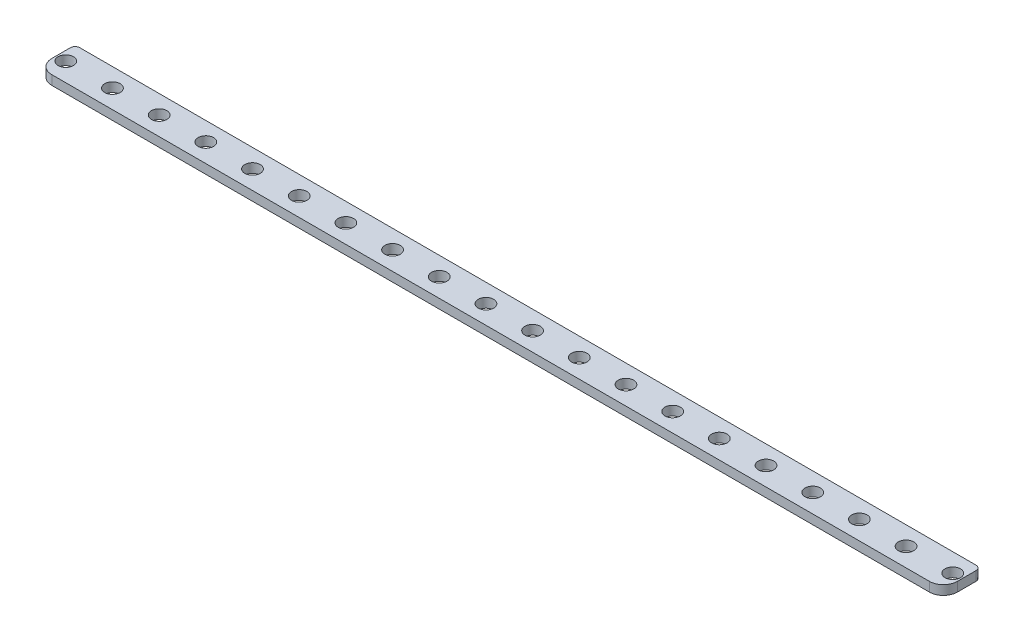
ISO-10303-21;
HEADER;
FILE_DESCRIPTION(('STEP AP214'),'2;1');
FILE_NAME('part.step','',(''),(''),'','','');
FILE_SCHEMA(('AUTOMOTIVE_DESIGN { 1 0 10303 214 1 1 1 1 }'));
ENDSEC;
DATA;
#1=APPLICATION_CONTEXT('core data for automotive mechanical design processes');
#2=APPLICATION_PROTOCOL_DEFINITION('international standard','automotive_design',2000,#1);
#3=PRODUCT_CONTEXT('',#1,'mechanical');
#4=PRODUCT('Part','Part','',(#3));
#5=PRODUCT_RELATED_PRODUCT_CATEGORY('part','',(#4));
#6=PRODUCT_DEFINITION_FORMATION('','',#4);
#7=PRODUCT_DEFINITION_CONTEXT('part definition',#1,'design');
#8=PRODUCT_DEFINITION('design','',#6,#7);
#9=PRODUCT_DEFINITION_SHAPE('','',#8);
#10=(LENGTH_UNIT() NAMED_UNIT(*) SI_UNIT(.MILLI.,.METRE.));
#11=(NAMED_UNIT(*) PLANE_ANGLE_UNIT() SI_UNIT($,.RADIAN.));
#12=(NAMED_UNIT(*) SI_UNIT($,.STERADIAN.) SOLID_ANGLE_UNIT());
#13=UNCERTAINTY_MEASURE_WITH_UNIT(LENGTH_MEASURE(1.E-05),#10,'distance_accuracy_value','');
#14=(GEOMETRIC_REPRESENTATION_CONTEXT(3) GLOBAL_UNCERTAINTY_ASSIGNED_CONTEXT((#13)) GLOBAL_UNIT_ASSIGNED_CONTEXT((#10,
#11,#12)) REPRESENTATION_CONTEXT('',''));
#15=CARTESIAN_POINT('',(0.,0.,0.));
#16=DIRECTION('',(0.,0.,1.));
#17=DIRECTION('',(1.,0.,0.));
#18=AXIS2_PLACEMENT_3D('',#15,#16,#17);
#19=CARTESIAN_POINT('',(-485.,-71.,-40.));
#20=DIRECTION('',(1.,0.,0.));
#21=DIRECTION('',(0.,0.,-1.));
#22=AXIS2_PLACEMENT_3D('',#19,#20,#21);
#23=PLANE('',#22);
#24=DIRECTION('',(0.,0.,1.));
#25=VECTOR('',#24,1.);
#26=CARTESIAN_POINT('',(-485.,-71.,-40.));
#27=LINE('',#26,#25);
#28=CARTESIAN_POINT('',(-485.,-71.,-35.));
#29=VERTEX_POINT('',#28);
#30=CARTESIAN_POINT('',(-485.,-71.,-15.));
#31=VERTEX_POINT('',#30);
#32=EDGE_CURVE('E129',#29,#31,#27,.T.);
#33=ORIENTED_EDGE('',*,*,#32,.T.);
#34=DIRECTION('',(0.,1.,0.));
#35=VECTOR('',#34,1.);
#36=CARTESIAN_POINT('',(-485.,-71.,-15.));
#37=LINE('',#36,#35);
#38=CARTESIAN_POINT('',(-485.,-61.,-15.));
#39=VERTEX_POINT('',#38);
#40=EDGE_CURVE('E143',#39,#31,#37,.F.);
#41=ORIENTED_EDGE('',*,*,#40,.F.);
#42=DIRECTION('',(0.,0.,1.));
#43=VECTOR('',#42,1.);
#44=CARTESIAN_POINT('',(-485.,-61.,-40.));
#45=LINE('',#44,#43);
#46=CARTESIAN_POINT('',(-485.,-61.,-35.));
#47=VERTEX_POINT('',#46);
#48=EDGE_CURVE('E131',#47,#39,#45,.T.);
#49=ORIENTED_EDGE('',*,*,#48,.F.);
#50=DIRECTION('',(0.,1.,0.));
#51=VECTOR('',#50,1.);
#52=CARTESIAN_POINT('',(-485.,-71.,-35.));
#53=LINE('',#52,#51);
#54=EDGE_CURVE('E11',#29,#47,#53,.T.);
#55=ORIENTED_EDGE('',*,*,#54,.F.);
#56=EDGE_LOOP('',(#33,#41,#49,#55));
#57=FACE_BOUND('',#56,.T.);
#58=ADVANCED_FACE('F35',(#57),#23,.F.);
#59=CARTESIAN_POINT('',(-485.,-71.,0.));
#60=DIRECTION('',(0.,0.,-1.));
#61=DIRECTION('',(0.,-1.,0.));
#62=AXIS2_PLACEMENT_3D('',#59,#60,#61);
#63=PLANE('',#62);
#64=DIRECTION('',(1.,0.,0.));
#65=VECTOR('',#64,1.);
#66=CARTESIAN_POINT('',(-485.,-61.,0.));
#67=LINE('',#66,#65);
#68=CARTESIAN_POINT('',(-470.,-61.,0.));
#69=VERTEX_POINT('',#68);
#70=CARTESIAN_POINT('',(470.,-61.,0.));
#71=VERTEX_POINT('',#70);
#72=EDGE_CURVE('E109',#69,#71,#67,.T.);
#73=ORIENTED_EDGE('',*,*,#72,.F.);
#74=DIRECTION('',(0.,1.,0.));
#75=VECTOR('',#74,1.);
#76=CARTESIAN_POINT('',(-470.,-71.,0.));
#77=LINE('',#76,#75);
#78=CARTESIAN_POINT('',(-470.,-71.,0.));
#79=VERTEX_POINT('',#78);
#80=EDGE_CURVE('E113',#79,#69,#77,.T.);
#81=ORIENTED_EDGE('',*,*,#80,.F.);
#82=DIRECTION('',(1.,0.,0.));
#83=VECTOR('',#82,1.);
#84=CARTESIAN_POINT('',(-485.,-71.,0.));
#85=LINE('',#84,#83);
#86=CARTESIAN_POINT('',(470.,-71.,0.));
#87=VERTEX_POINT('',#86);
#88=EDGE_CURVE('E280',#79,#87,#85,.T.);
#89=ORIENTED_EDGE('',*,*,#88,.T.);
#90=DIRECTION('',(0.,1.,0.));
#91=VECTOR('',#90,1.);
#92=CARTESIAN_POINT('',(470.,-71.,0.));
#93=LINE('',#92,#91);
#94=EDGE_CURVE('E138',#71,#87,#93,.F.);
#95=ORIENTED_EDGE('',*,*,#94,.F.);
#96=EDGE_LOOP('',(#73,#81,#89,#95));
#97=FACE_BOUND('',#96,.T.);
#98=ADVANCED_FACE('F296',(#97),#63,.F.);
#99=CARTESIAN_POINT('',(485.,-71.,-40.));
#100=DIRECTION('',(-1.,0.,0.));
#101=DIRECTION('',(0.,0.,1.));
#102=AXIS2_PLACEMENT_3D('',#99,#100,#101);
#103=PLANE('',#102);
#104=DIRECTION('',(0.,0.,-1.));
#105=VECTOR('',#104,1.);
#106=CARTESIAN_POINT('',(485.,-61.,-40.));
#107=LINE('',#106,#105);
#108=CARTESIAN_POINT('',(485.,-61.,-15.));
#109=VERTEX_POINT('',#108);
#110=CARTESIAN_POINT('',(485.,-61.,-35.));
#111=VERTEX_POINT('',#110);
#112=EDGE_CURVE('E107',#109,#111,#107,.T.);
#113=ORIENTED_EDGE('',*,*,#112,.F.);
#114=DIRECTION('',(0.,1.,0.));
#115=VECTOR('',#114,1.);
#116=CARTESIAN_POINT('',(485.,-71.,-15.));
#117=LINE('',#116,#115);
#118=CARTESIAN_POINT('',(485.,-71.,-15.));
#119=VERTEX_POINT('',#118);
#120=EDGE_CURVE('E117',#119,#109,#117,.T.);
#121=ORIENTED_EDGE('',*,*,#120,.F.);
#122=DIRECTION('',(0.,0.,-1.));
#123=VECTOR('',#122,1.);
#124=CARTESIAN_POINT('',(485.,-71.,-40.));
#125=LINE('',#124,#123);
#126=CARTESIAN_POINT('',(485.,-71.,-35.));
#127=VERTEX_POINT('',#126);
#128=EDGE_CURVE('E283',#119,#127,#125,.T.);
#129=ORIENTED_EDGE('',*,*,#128,.T.);
#130=DIRECTION('',(0.,1.,0.));
#131=VECTOR('',#130,1.);
#132=CARTESIAN_POINT('',(485.,-71.,-35.));
#133=LINE('',#132,#131);
#134=EDGE_CURVE('E126',#111,#127,#133,.F.);
#135=ORIENTED_EDGE('',*,*,#134,.F.);
#136=EDGE_LOOP('',(#113,#121,#129,#135));
#137=FACE_BOUND('',#136,.T.);
#138=ADVANCED_FACE('F125',(#137),#103,.F.);
#139=CARTESIAN_POINT('',(-485.,-71.,-40.));
#140=DIRECTION('',(0.,0.,1.));
#141=DIRECTION('',(0.,1.,0.));
#142=AXIS2_PLACEMENT_3D('',#139,#140,#141);
#143=PLANE('',#142);
#144=DIRECTION('',(-1.,0.,0.));
#145=VECTOR('',#144,1.);
#146=CARTESIAN_POINT('',(-485.,-71.,-40.));
#147=LINE('',#146,#145);
#148=CARTESIAN_POINT('',(480.,-71.,-40.));
#149=VERTEX_POINT('',#148);
#150=CARTESIAN_POINT('',(-480.,-71.,-40.));
#151=VERTEX_POINT('',#150);
#152=EDGE_CURVE('E122',#149,#151,#147,.T.);
#153=ORIENTED_EDGE('',*,*,#152,.T.);
#154=DIRECTION('',(0.,1.,0.));
#155=VECTOR('',#154,1.);
#156=CARTESIAN_POINT('',(-480.,-71.,-40.));
#157=LINE('',#156,#155);
#158=CARTESIAN_POINT('',(-480.,-61.,-40.));
#159=VERTEX_POINT('',#158);
#160=EDGE_CURVE('E146',#159,#151,#157,.F.);
#161=ORIENTED_EDGE('',*,*,#160,.F.);
#162=DIRECTION('',(-1.,0.,0.));
#163=VECTOR('',#162,1.);
#164=CARTESIAN_POINT('',(-485.,-61.,-40.));
#165=LINE('',#164,#163);
#166=CARTESIAN_POINT('',(480.,-61.,-40.));
#167=VERTEX_POINT('',#166);
#168=EDGE_CURVE('E127',#167,#159,#165,.T.);
#169=ORIENTED_EDGE('',*,*,#168,.F.);
#170=DIRECTION('',(0.,1.,0.));
#171=VECTOR('',#170,1.);
#172=CARTESIAN_POINT('',(480.,-71.,-40.));
#173=LINE('',#172,#171);
#174=EDGE_CURVE('E148',#149,#167,#173,.T.);
#175=ORIENTED_EDGE('',*,*,#174,.F.);
#176=EDGE_LOOP('',(#153,#161,#169,#175));
#177=FACE_BOUND('',#176,.T.);
#178=ADVANCED_FACE('F302',(#177),#143,.F.);
#179=CARTESIAN_POINT('',(0.,-71.,0.));
#180=DIRECTION('',(0.,-1.,0.));
#181=DIRECTION('',(0.,0.,1.));
#182=AXIS2_PLACEMENT_3D('',#179,#180,#181);
#183=PLANE('',#182);
#184=CARTESIAN_POINT('',(475.,-71.,-20.));
#185=DIRECTION('',(0.,1.,0.));
#186=DIRECTION('',(0.,0.,1.));
#187=AXIS2_PLACEMENT_3D('',#184,#185,#186);
#188=CIRCLE('',#187,8.24999999999999);
#189=CARTESIAN_POINT('',(475.,-71.,-11.75));
#190=VERTEX_POINT('',#189);
#191=EDGE_CURVE('E241',#190,#190,#188,.T.);
#192=ORIENTED_EDGE('',*,*,#191,.T.);
#193=EDGE_LOOP('',(#192));
#194=FACE_BOUND('',#193,.T.);
#195=CARTESIAN_POINT('',(425.,-71.,-20.));
#196=DIRECTION('',(0.,1.,0.));
#197=DIRECTION('',(0.,0.,1.));
#198=AXIS2_PLACEMENT_3D('',#195,#196,#197);
#199=CIRCLE('',#198,8.24999999999999);
#200=CARTESIAN_POINT('',(425.,-71.,-11.75));
#201=VERTEX_POINT('',#200);
#202=EDGE_CURVE('E231',#201,#201,#199,.T.);
#203=ORIENTED_EDGE('',*,*,#202,.T.);
#204=EDGE_LOOP('',(#203));
#205=FACE_BOUND('',#204,.T.);
#206=CARTESIAN_POINT('',(375.,-71.,-20.));
#207=DIRECTION('',(0.,1.,0.));
#208=DIRECTION('',(0.,0.,1.));
#209=AXIS2_PLACEMENT_3D('',#206,#207,#208);
#210=CIRCLE('',#209,8.24999999999999);
#211=CARTESIAN_POINT('',(375.,-71.,-11.75));
#212=VERTEX_POINT('',#211);
#213=EDGE_CURVE('E228',#212,#212,#210,.T.);
#214=ORIENTED_EDGE('',*,*,#213,.T.);
#215=EDGE_LOOP('',(#214));
#216=FACE_BOUND('',#215,.T.);
#217=CARTESIAN_POINT('',(325.,-71.,-20.));
#218=DIRECTION('',(0.,1.,0.));
#219=DIRECTION('',(0.,0.,1.));
#220=AXIS2_PLACEMENT_3D('',#217,#218,#219);
#221=CIRCLE('',#220,8.24999999999999);
#222=CARTESIAN_POINT('',(325.,-71.,-11.75));
#223=VERTEX_POINT('',#222);
#224=EDGE_CURVE('E225',#223,#223,#221,.T.);
#225=ORIENTED_EDGE('',*,*,#224,.T.);
#226=EDGE_LOOP('',(#225));
#227=FACE_BOUND('',#226,.T.);
#228=CARTESIAN_POINT('',(275.,-71.,-20.));
#229=DIRECTION('',(0.,1.,0.));
#230=DIRECTION('',(0.,0.,1.));
#231=AXIS2_PLACEMENT_3D('',#228,#229,#230);
#232=CIRCLE('',#231,8.24999999999999);
#233=CARTESIAN_POINT('',(275.,-71.,-11.75));
#234=VERTEX_POINT('',#233);
#235=EDGE_CURVE('E221',#234,#234,#232,.T.);
#236=ORIENTED_EDGE('',*,*,#235,.T.);
#237=EDGE_LOOP('',(#236));
#238=FACE_BOUND('',#237,.T.);
#239=CARTESIAN_POINT('',(225.,-71.,-20.));
#240=DIRECTION('',(0.,1.,0.));
#241=DIRECTION('',(0.,0.,1.));
#242=AXIS2_PLACEMENT_3D('',#239,#240,#241);
#243=CIRCLE('',#242,8.24999999999999);
#244=CARTESIAN_POINT('',(225.,-71.,-11.75));
#245=VERTEX_POINT('',#244);
#246=EDGE_CURVE('E217',#245,#245,#243,.T.);
#247=ORIENTED_EDGE('',*,*,#246,.T.);
#248=EDGE_LOOP('',(#247));
#249=FACE_BOUND('',#248,.T.);
#250=CARTESIAN_POINT('',(175.,-71.,-20.));
#251=DIRECTION('',(0.,1.,0.));
#252=DIRECTION('',(0.,0.,1.));
#253=AXIS2_PLACEMENT_3D('',#250,#251,#252);
#254=CIRCLE('',#253,8.24999999999999);
#255=CARTESIAN_POINT('',(175.,-71.,-11.75));
#256=VERTEX_POINT('',#255);
#257=EDGE_CURVE('E213',#256,#256,#254,.T.);
#258=ORIENTED_EDGE('',*,*,#257,.T.);
#259=EDGE_LOOP('',(#258));
#260=FACE_BOUND('',#259,.T.);
#261=CARTESIAN_POINT('',(125.,-71.,-20.));
#262=DIRECTION('',(0.,1.,0.));
#263=DIRECTION('',(0.,0.,1.));
#264=AXIS2_PLACEMENT_3D('',#261,#262,#263);
#265=CIRCLE('',#264,8.24999999999999);
#266=CARTESIAN_POINT('',(125.,-71.,-11.75));
#267=VERTEX_POINT('',#266);
#268=EDGE_CURVE('E209',#267,#267,#265,.T.);
#269=ORIENTED_EDGE('',*,*,#268,.T.);
#270=EDGE_LOOP('',(#269));
#271=FACE_BOUND('',#270,.T.);
#272=CARTESIAN_POINT('',(75.,-71.,-20.));
#273=DIRECTION('',(0.,1.,0.));
#274=DIRECTION('',(0.,0.,1.));
#275=AXIS2_PLACEMENT_3D('',#272,#273,#274);
#276=CIRCLE('',#275,8.24999999999999);
#277=CARTESIAN_POINT('',(75.,-71.,-11.75));
#278=VERTEX_POINT('',#277);
#279=EDGE_CURVE('E205',#278,#278,#276,.T.);
#280=ORIENTED_EDGE('',*,*,#279,.T.);
#281=EDGE_LOOP('',(#280));
#282=FACE_BOUND('',#281,.T.);
#283=CARTESIAN_POINT('',(25.,-71.,-20.));
#284=DIRECTION('',(0.,1.,0.));
#285=DIRECTION('',(0.,0.,1.));
#286=AXIS2_PLACEMENT_3D('',#283,#284,#285);
#287=CIRCLE('',#286,8.24999999999999);
#288=CARTESIAN_POINT('',(25.,-71.,-11.75));
#289=VERTEX_POINT('',#288);
#290=EDGE_CURVE('E201',#289,#289,#287,.T.);
#291=ORIENTED_EDGE('',*,*,#290,.T.);
#292=EDGE_LOOP('',(#291));
#293=FACE_BOUND('',#292,.T.);
#294=CARTESIAN_POINT('',(-25.,-71.,-20.));
#295=DIRECTION('',(0.,1.,0.));
#296=DIRECTION('',(0.,0.,1.));
#297=AXIS2_PLACEMENT_3D('',#294,#295,#296);
#298=CIRCLE('',#297,8.24999999999999);
#299=CARTESIAN_POINT('',(-25.,-71.,-11.75));
#300=VERTEX_POINT('',#299);
#301=EDGE_CURVE('E197',#300,#300,#298,.T.);
#302=ORIENTED_EDGE('',*,*,#301,.T.);
#303=EDGE_LOOP('',(#302));
#304=FACE_BOUND('',#303,.T.);
#305=CARTESIAN_POINT('',(-75.,-71.,-20.));
#306=DIRECTION('',(0.,1.,0.));
#307=DIRECTION('',(0.,0.,1.));
#308=AXIS2_PLACEMENT_3D('',#305,#306,#307);
#309=CIRCLE('',#308,8.24999999999999);
#310=CARTESIAN_POINT('',(-75.,-71.,-11.75));
#311=VERTEX_POINT('',#310);
#312=EDGE_CURVE('E193',#311,#311,#309,.T.);
#313=ORIENTED_EDGE('',*,*,#312,.T.);
#314=EDGE_LOOP('',(#313));
#315=FACE_BOUND('',#314,.T.);
#316=CARTESIAN_POINT('',(-125.,-71.,-20.));
#317=DIRECTION('',(0.,1.,0.));
#318=DIRECTION('',(0.,0.,1.));
#319=AXIS2_PLACEMENT_3D('',#316,#317,#318);
#320=CIRCLE('',#319,8.24999999999999);
#321=CARTESIAN_POINT('',(-125.,-71.,-11.75));
#322=VERTEX_POINT('',#321);
#323=EDGE_CURVE('E189',#322,#322,#320,.T.);
#324=ORIENTED_EDGE('',*,*,#323,.T.);
#325=EDGE_LOOP('',(#324));
#326=FACE_BOUND('',#325,.T.);
#327=CARTESIAN_POINT('',(-175.,-71.,-20.));
#328=DIRECTION('',(0.,1.,0.));
#329=DIRECTION('',(0.,0.,1.));
#330=AXIS2_PLACEMENT_3D('',#327,#328,#329);
#331=CIRCLE('',#330,8.24999999999999);
#332=CARTESIAN_POINT('',(-175.,-71.,-11.75));
#333=VERTEX_POINT('',#332);
#334=EDGE_CURVE('E185',#333,#333,#331,.T.);
#335=ORIENTED_EDGE('',*,*,#334,.T.);
#336=EDGE_LOOP('',(#335));
#337=FACE_BOUND('',#336,.T.);
#338=CARTESIAN_POINT('',(-225.,-71.,-20.));
#339=DIRECTION('',(0.,1.,0.));
#340=DIRECTION('',(0.,0.,1.));
#341=AXIS2_PLACEMENT_3D('',#338,#339,#340);
#342=CIRCLE('',#341,8.24999999999999);
#343=CARTESIAN_POINT('',(-225.,-71.,-11.75));
#344=VERTEX_POINT('',#343);
#345=EDGE_CURVE('E181',#344,#344,#342,.T.);
#346=ORIENTED_EDGE('',*,*,#345,.T.);
#347=EDGE_LOOP('',(#346));
#348=FACE_BOUND('',#347,.T.);
#349=CARTESIAN_POINT('',(-275.,-71.,-20.));
#350=DIRECTION('',(0.,1.,0.));
#351=DIRECTION('',(0.,0.,1.));
#352=AXIS2_PLACEMENT_3D('',#349,#350,#351);
#353=CIRCLE('',#352,8.24999999999999);
#354=CARTESIAN_POINT('',(-275.,-71.,-11.75));
#355=VERTEX_POINT('',#354);
#356=EDGE_CURVE('E177',#355,#355,#353,.T.);
#357=ORIENTED_EDGE('',*,*,#356,.T.);
#358=EDGE_LOOP('',(#357));
#359=FACE_BOUND('',#358,.T.);
#360=CARTESIAN_POINT('',(-325.,-71.,-20.));
#361=DIRECTION('',(0.,1.,0.));
#362=DIRECTION('',(0.,0.,1.));
#363=AXIS2_PLACEMENT_3D('',#360,#361,#362);
#364=CIRCLE('',#363,8.24999999999999);
#365=CARTESIAN_POINT('',(-325.,-71.,-11.75));
#366=VERTEX_POINT('',#365);
#367=EDGE_CURVE('E173',#366,#366,#364,.T.);
#368=ORIENTED_EDGE('',*,*,#367,.T.);
#369=EDGE_LOOP('',(#368));
#370=FACE_BOUND('',#369,.T.);
#371=CARTESIAN_POINT('',(-375.,-71.,-20.));
#372=DIRECTION('',(0.,1.,0.));
#373=DIRECTION('',(0.,0.,1.));
#374=AXIS2_PLACEMENT_3D('',#371,#372,#373);
#375=CIRCLE('',#374,8.24999999999999);
#376=CARTESIAN_POINT('',(-375.,-71.,-11.75));
#377=VERTEX_POINT('',#376);
#378=EDGE_CURVE('E169',#377,#377,#375,.T.);
#379=ORIENTED_EDGE('',*,*,#378,.T.);
#380=EDGE_LOOP('',(#379));
#381=FACE_BOUND('',#380,.T.);
#382=CARTESIAN_POINT('',(-425.,-71.,-20.));
#383=DIRECTION('',(0.,1.,0.));
#384=DIRECTION('',(0.,0.,1.));
#385=AXIS2_PLACEMENT_3D('',#382,#383,#384);
#386=CIRCLE('',#385,8.24999999999999);
#387=CARTESIAN_POINT('',(-425.,-71.,-11.75));
#388=VERTEX_POINT('',#387);
#389=EDGE_CURVE('E165',#388,#388,#386,.T.);
#390=ORIENTED_EDGE('',*,*,#389,.T.);
#391=EDGE_LOOP('',(#390));
#392=FACE_BOUND('',#391,.T.);
#393=CARTESIAN_POINT('',(-475.,-71.,-20.));
#394=DIRECTION('',(0.,1.,0.));
#395=DIRECTION('',(0.,0.,1.));
#396=AXIS2_PLACEMENT_3D('',#393,#394,#395);
#397=CIRCLE('',#396,8.24999999999999);
#398=CARTESIAN_POINT('',(-475.,-71.,-11.75));
#399=VERTEX_POINT('',#398);
#400=EDGE_CURVE('E161',#399,#399,#397,.T.);
#401=ORIENTED_EDGE('',*,*,#400,.T.);
#402=EDGE_LOOP('',(#401));
#403=FACE_BOUND('',#402,.T.);
#404=ORIENTED_EDGE('',*,*,#128,.F.);
#405=CARTESIAN_POINT('',(470.,-71.,-15.));
#406=DIRECTION('',(0.,1.,0.));
#407=DIRECTION('',(0.,0.,1.));
#408=AXIS2_PLACEMENT_3D('',#405,#406,#407);
#409=CIRCLE('',#408,15.);
#410=EDGE_CURVE('E119',#87,#119,#409,.T.);
#411=ORIENTED_EDGE('',*,*,#410,.F.);
#412=ORIENTED_EDGE('',*,*,#88,.F.);
#413=CARTESIAN_POINT('',(-470.,-71.,-15.));
#414=DIRECTION('',(0.,1.,0.));
#415=DIRECTION('',(0.,0.,1.));
#416=AXIS2_PLACEMENT_3D('',#413,#414,#415);
#417=CIRCLE('',#416,15.);
#418=EDGE_CURVE('E140',#31,#79,#417,.T.);
#419=ORIENTED_EDGE('',*,*,#418,.F.);
#420=ORIENTED_EDGE('',*,*,#32,.F.);
#421=CARTESIAN_POINT('',(-480.,-71.,-35.));
#422=DIRECTION('',(0.,1.,0.));
#423=DIRECTION('',(0.,0.,1.));
#424=AXIS2_PLACEMENT_3D('',#421,#422,#423);
#425=CIRCLE('',#424,5.);
#426=EDGE_CURVE('E51',#151,#29,#425,.T.);
#427=ORIENTED_EDGE('',*,*,#426,.F.);
#428=ORIENTED_EDGE('',*,*,#152,.F.);
#429=CARTESIAN_POINT('',(480.,-71.,-35.));
#430=DIRECTION('',(0.,1.,0.));
#431=DIRECTION('',(0.,0.,1.));
#432=AXIS2_PLACEMENT_3D('',#429,#430,#431);
#433=CIRCLE('',#432,5.);
#434=EDGE_CURVE('E44',#127,#149,#433,.T.);
#435=ORIENTED_EDGE('',*,*,#434,.F.);
#436=EDGE_LOOP('',(#404,#411,#412,#419,#420,#427,#428,#435));
#437=FACE_BOUND('',#436,.T.);
#438=ADVANCED_FACE('F297',(#194,#205,#216,#227,#238,#249,#260,#271,#282,#293,#304,#315,#326,
#337,#348,#359,#370,#381,#392,#403,#437),#183,.T.);
#439=CARTESIAN_POINT('',(0.,-61.,0.));
#440=DIRECTION('',(0.,-1.,0.));
#441=DIRECTION('',(0.,0.,1.));
#442=AXIS2_PLACEMENT_3D('',#439,#440,#441);
#443=PLANE('',#442);
#444=CARTESIAN_POINT('',(475.,-61.,-20.));
#445=DIRECTION('',(0.,-1.,0.));
#446=DIRECTION('',(0.,0.,-1.));
#447=AXIS2_PLACEMENT_3D('',#444,#445,#446);
#448=CIRCLE('',#447,8.24999999999999);
#449=CARTESIAN_POINT('',(475.,-61.,-28.25));
#450=VERTEX_POINT('',#449);
#451=EDGE_CURVE('E39',#450,#450,#448,.T.);
#452=ORIENTED_EDGE('',*,*,#451,.T.);
#453=EDGE_LOOP('',(#452));
#454=FACE_BOUND('',#453,.T.);
#455=CARTESIAN_POINT('',(425.,-61.,-20.));
#456=DIRECTION('',(0.,-1.,0.));
#457=DIRECTION('',(0.,0.,-1.));
#458=AXIS2_PLACEMENT_3D('',#455,#456,#457);
#459=CIRCLE('',#458,8.24999999999999);
#460=CARTESIAN_POINT('',(425.,-61.,-28.25));
#461=VERTEX_POINT('',#460);
#462=EDGE_CURVE('E229',#461,#461,#459,.T.);
#463=ORIENTED_EDGE('',*,*,#462,.T.);
#464=EDGE_LOOP('',(#463));
#465=FACE_BOUND('',#464,.T.);
#466=CARTESIAN_POINT('',(375.,-61.,-20.));
#467=DIRECTION('',(0.,-1.,0.));
#468=DIRECTION('',(0.,0.,-1.));
#469=AXIS2_PLACEMENT_3D('',#466,#467,#468);
#470=CIRCLE('',#469,8.24999999999999);
#471=CARTESIAN_POINT('',(375.,-61.,-28.25));
#472=VERTEX_POINT('',#471);
#473=EDGE_CURVE('E226',#472,#472,#470,.T.);
#474=ORIENTED_EDGE('',*,*,#473,.T.);
#475=EDGE_LOOP('',(#474));
#476=FACE_BOUND('',#475,.T.);
#477=CARTESIAN_POINT('',(325.,-61.,-20.));
#478=DIRECTION('',(0.,-1.,0.));
#479=DIRECTION('',(0.,0.,-1.));
#480=AXIS2_PLACEMENT_3D('',#477,#478,#479);
#481=CIRCLE('',#480,8.24999999999999);
#482=CARTESIAN_POINT('',(325.,-61.,-28.25));
#483=VERTEX_POINT('',#482);
#484=EDGE_CURVE('E222',#483,#483,#481,.T.);
#485=ORIENTED_EDGE('',*,*,#484,.T.);
#486=EDGE_LOOP('',(#485));
#487=FACE_BOUND('',#486,.T.);
#488=CARTESIAN_POINT('',(275.,-61.,-20.));
#489=DIRECTION('',(0.,-1.,0.));
#490=DIRECTION('',(0.,0.,-1.));
#491=AXIS2_PLACEMENT_3D('',#488,#489,#490);
#492=CIRCLE('',#491,8.24999999999999);
#493=CARTESIAN_POINT('',(275.,-61.,-28.25));
#494=VERTEX_POINT('',#493);
#495=EDGE_CURVE('E218',#494,#494,#492,.T.);
#496=ORIENTED_EDGE('',*,*,#495,.T.);
#497=EDGE_LOOP('',(#496));
#498=FACE_BOUND('',#497,.T.);
#499=CARTESIAN_POINT('',(225.,-61.,-20.));
#500=DIRECTION('',(0.,-1.,0.));
#501=DIRECTION('',(0.,0.,-1.));
#502=AXIS2_PLACEMENT_3D('',#499,#500,#501);
#503=CIRCLE('',#502,8.24999999999999);
#504=CARTESIAN_POINT('',(225.,-61.,-28.25));
#505=VERTEX_POINT('',#504);
#506=EDGE_CURVE('E214',#505,#505,#503,.T.);
#507=ORIENTED_EDGE('',*,*,#506,.T.);
#508=EDGE_LOOP('',(#507));
#509=FACE_BOUND('',#508,.T.);
#510=CARTESIAN_POINT('',(175.,-61.,-20.));
#511=DIRECTION('',(0.,-1.,0.));
#512=DIRECTION('',(0.,0.,-1.));
#513=AXIS2_PLACEMENT_3D('',#510,#511,#512);
#514=CIRCLE('',#513,8.24999999999999);
#515=CARTESIAN_POINT('',(175.,-61.,-28.25));
#516=VERTEX_POINT('',#515);
#517=EDGE_CURVE('E210',#516,#516,#514,.T.);
#518=ORIENTED_EDGE('',*,*,#517,.T.);
#519=EDGE_LOOP('',(#518));
#520=FACE_BOUND('',#519,.T.);
#521=CARTESIAN_POINT('',(125.,-61.,-20.));
#522=DIRECTION('',(0.,-1.,0.));
#523=DIRECTION('',(0.,0.,-1.));
#524=AXIS2_PLACEMENT_3D('',#521,#522,#523);
#525=CIRCLE('',#524,8.24999999999999);
#526=CARTESIAN_POINT('',(125.,-61.,-28.25));
#527=VERTEX_POINT('',#526);
#528=EDGE_CURVE('E206',#527,#527,#525,.T.);
#529=ORIENTED_EDGE('',*,*,#528,.T.);
#530=EDGE_LOOP('',(#529));
#531=FACE_BOUND('',#530,.T.);
#532=CARTESIAN_POINT('',(75.,-61.,-20.));
#533=DIRECTION('',(0.,-1.,0.));
#534=DIRECTION('',(0.,0.,-1.));
#535=AXIS2_PLACEMENT_3D('',#532,#533,#534);
#536=CIRCLE('',#535,8.24999999999999);
#537=CARTESIAN_POINT('',(75.,-61.,-28.25));
#538=VERTEX_POINT('',#537);
#539=EDGE_CURVE('E202',#538,#538,#536,.T.);
#540=ORIENTED_EDGE('',*,*,#539,.T.);
#541=EDGE_LOOP('',(#540));
#542=FACE_BOUND('',#541,.T.);
#543=CARTESIAN_POINT('',(25.,-61.,-20.));
#544=DIRECTION('',(0.,-1.,0.));
#545=DIRECTION('',(0.,0.,-1.));
#546=AXIS2_PLACEMENT_3D('',#543,#544,#545);
#547=CIRCLE('',#546,8.24999999999999);
#548=CARTESIAN_POINT('',(25.,-61.,-28.25));
#549=VERTEX_POINT('',#548);
#550=EDGE_CURVE('E198',#549,#549,#547,.T.);
#551=ORIENTED_EDGE('',*,*,#550,.T.);
#552=EDGE_LOOP('',(#551));
#553=FACE_BOUND('',#552,.T.);
#554=CARTESIAN_POINT('',(-25.,-61.,-20.));
#555=DIRECTION('',(0.,-1.,0.));
#556=DIRECTION('',(0.,0.,-1.));
#557=AXIS2_PLACEMENT_3D('',#554,#555,#556);
#558=CIRCLE('',#557,8.24999999999999);
#559=CARTESIAN_POINT('',(-25.,-61.,-28.25));
#560=VERTEX_POINT('',#559);
#561=EDGE_CURVE('E194',#560,#560,#558,.T.);
#562=ORIENTED_EDGE('',*,*,#561,.T.);
#563=EDGE_LOOP('',(#562));
#564=FACE_BOUND('',#563,.T.);
#565=CARTESIAN_POINT('',(-75.,-61.,-20.));
#566=DIRECTION('',(0.,-1.,0.));
#567=DIRECTION('',(0.,0.,-1.));
#568=AXIS2_PLACEMENT_3D('',#565,#566,#567);
#569=CIRCLE('',#568,8.24999999999999);
#570=CARTESIAN_POINT('',(-75.,-61.,-28.25));
#571=VERTEX_POINT('',#570);
#572=EDGE_CURVE('E190',#571,#571,#569,.T.);
#573=ORIENTED_EDGE('',*,*,#572,.T.);
#574=EDGE_LOOP('',(#573));
#575=FACE_BOUND('',#574,.T.);
#576=CARTESIAN_POINT('',(-125.,-61.,-20.));
#577=DIRECTION('',(0.,-1.,0.));
#578=DIRECTION('',(0.,0.,-1.));
#579=AXIS2_PLACEMENT_3D('',#576,#577,#578);
#580=CIRCLE('',#579,8.24999999999999);
#581=CARTESIAN_POINT('',(-125.,-61.,-28.25));
#582=VERTEX_POINT('',#581);
#583=EDGE_CURVE('E186',#582,#582,#580,.T.);
#584=ORIENTED_EDGE('',*,*,#583,.T.);
#585=EDGE_LOOP('',(#584));
#586=FACE_BOUND('',#585,.T.);
#587=CARTESIAN_POINT('',(-175.,-61.,-20.));
#588=DIRECTION('',(0.,-1.,0.));
#589=DIRECTION('',(0.,0.,-1.));
#590=AXIS2_PLACEMENT_3D('',#587,#588,#589);
#591=CIRCLE('',#590,8.24999999999999);
#592=CARTESIAN_POINT('',(-175.,-61.,-28.25));
#593=VERTEX_POINT('',#592);
#594=EDGE_CURVE('E182',#593,#593,#591,.T.);
#595=ORIENTED_EDGE('',*,*,#594,.T.);
#596=EDGE_LOOP('',(#595));
#597=FACE_BOUND('',#596,.T.);
#598=CARTESIAN_POINT('',(-225.,-61.,-20.));
#599=DIRECTION('',(0.,-1.,0.));
#600=DIRECTION('',(0.,0.,-1.));
#601=AXIS2_PLACEMENT_3D('',#598,#599,#600);
#602=CIRCLE('',#601,8.24999999999999);
#603=CARTESIAN_POINT('',(-225.,-61.,-28.25));
#604=VERTEX_POINT('',#603);
#605=EDGE_CURVE('E178',#604,#604,#602,.T.);
#606=ORIENTED_EDGE('',*,*,#605,.T.);
#607=EDGE_LOOP('',(#606));
#608=FACE_BOUND('',#607,.T.);
#609=CARTESIAN_POINT('',(-275.,-61.,-20.));
#610=DIRECTION('',(0.,-1.,0.));
#611=DIRECTION('',(0.,0.,-1.));
#612=AXIS2_PLACEMENT_3D('',#609,#610,#611);
#613=CIRCLE('',#612,8.24999999999999);
#614=CARTESIAN_POINT('',(-275.,-61.,-28.25));
#615=VERTEX_POINT('',#614);
#616=EDGE_CURVE('E174',#615,#615,#613,.T.);
#617=ORIENTED_EDGE('',*,*,#616,.T.);
#618=EDGE_LOOP('',(#617));
#619=FACE_BOUND('',#618,.T.);
#620=CARTESIAN_POINT('',(-325.,-61.,-20.));
#621=DIRECTION('',(0.,-1.,0.));
#622=DIRECTION('',(0.,0.,-1.));
#623=AXIS2_PLACEMENT_3D('',#620,#621,#622);
#624=CIRCLE('',#623,8.24999999999999);
#625=CARTESIAN_POINT('',(-325.,-61.,-28.25));
#626=VERTEX_POINT('',#625);
#627=EDGE_CURVE('E170',#626,#626,#624,.T.);
#628=ORIENTED_EDGE('',*,*,#627,.T.);
#629=EDGE_LOOP('',(#628));
#630=FACE_BOUND('',#629,.T.);
#631=CARTESIAN_POINT('',(-375.,-61.,-20.));
#632=DIRECTION('',(0.,-1.,0.));
#633=DIRECTION('',(0.,0.,-1.));
#634=AXIS2_PLACEMENT_3D('',#631,#632,#633);
#635=CIRCLE('',#634,8.24999999999999);
#636=CARTESIAN_POINT('',(-375.,-61.,-28.25));
#637=VERTEX_POINT('',#636);
#638=EDGE_CURVE('E166',#637,#637,#635,.T.);
#639=ORIENTED_EDGE('',*,*,#638,.T.);
#640=EDGE_LOOP('',(#639));
#641=FACE_BOUND('',#640,.T.);
#642=CARTESIAN_POINT('',(-425.,-61.,-20.));
#643=DIRECTION('',(0.,-1.,0.));
#644=DIRECTION('',(0.,0.,-1.));
#645=AXIS2_PLACEMENT_3D('',#642,#643,#644);
#646=CIRCLE('',#645,8.24999999999999);
#647=CARTESIAN_POINT('',(-425.,-61.,-28.25));
#648=VERTEX_POINT('',#647);
#649=EDGE_CURVE('E162',#648,#648,#646,.T.);
#650=ORIENTED_EDGE('',*,*,#649,.T.);
#651=EDGE_LOOP('',(#650));
#652=FACE_BOUND('',#651,.T.);
#653=CARTESIAN_POINT('',(-475.,-61.,-20.));
#654=DIRECTION('',(0.,-1.,0.));
#655=DIRECTION('',(0.,0.,-1.));
#656=AXIS2_PLACEMENT_3D('',#653,#654,#655);
#657=CIRCLE('',#656,8.24999999999999);
#658=CARTESIAN_POINT('',(-475.,-61.,-28.25));
#659=VERTEX_POINT('',#658);
#660=EDGE_CURVE('E158',#659,#659,#657,.T.);
#661=ORIENTED_EDGE('',*,*,#660,.T.);
#662=EDGE_LOOP('',(#661));
#663=FACE_BOUND('',#662,.T.);
#664=ORIENTED_EDGE('',*,*,#168,.T.);
#665=CARTESIAN_POINT('',(-480.,-61.,-35.));
#666=DIRECTION('',(0.,1.,0.));
#667=DIRECTION('',(0.,0.,1.));
#668=AXIS2_PLACEMENT_3D('',#665,#666,#667);
#669=CIRCLE('',#668,5.);
#670=EDGE_CURVE('E151',#47,#159,#669,.F.);
#671=ORIENTED_EDGE('',*,*,#670,.F.);
#672=ORIENTED_EDGE('',*,*,#48,.T.);
#673=CARTESIAN_POINT('',(-470.,-61.,-15.));
#674=DIRECTION('',(0.,1.,0.));
#675=DIRECTION('',(0.,0.,1.));
#676=AXIS2_PLACEMENT_3D('',#673,#674,#675);
#677=CIRCLE('',#676,15.);
#678=EDGE_CURVE('E114',#69,#39,#677,.F.);
#679=ORIENTED_EDGE('',*,*,#678,.F.);
#680=ORIENTED_EDGE('',*,*,#72,.T.);
#681=CARTESIAN_POINT('',(470.,-61.,-15.));
#682=DIRECTION('',(0.,1.,0.));
#683=DIRECTION('',(0.,0.,1.));
#684=AXIS2_PLACEMENT_3D('',#681,#682,#683);
#685=CIRCLE('',#684,15.);
#686=EDGE_CURVE('E102',#109,#71,#685,.F.);
#687=ORIENTED_EDGE('',*,*,#686,.F.);
#688=ORIENTED_EDGE('',*,*,#112,.T.);
#689=CARTESIAN_POINT('',(480.,-61.,-35.));
#690=DIRECTION('',(0.,1.,0.));
#691=DIRECTION('',(0.,0.,1.));
#692=AXIS2_PLACEMENT_3D('',#689,#690,#691);
#693=CIRCLE('',#692,5.);
#694=EDGE_CURVE('E153',#167,#111,#693,.F.);
#695=ORIENTED_EDGE('',*,*,#694,.F.);
#696=EDGE_LOOP('',(#664,#671,#672,#679,#680,#687,#688,#695));
#697=FACE_BOUND('',#696,.T.);
#698=ADVANCED_FACE('F105',(#454,#465,#476,#487,#498,#509,#520,#531,#542,#553,#564,#575,#586,
#597,#608,#619,#630,#641,#652,#663,#697),#443,.F.);
#699=CARTESIAN_POINT('',(470.,-71.,-15.));
#700=DIRECTION('',(0.,1.,0.));
#701=DIRECTION('',(1.,0.,0.));
#702=AXIS2_PLACEMENT_3D('',#699,#700,#701);
#703=CYLINDRICAL_SURFACE('',#702,15.);
#704=ORIENTED_EDGE('',*,*,#410,.T.);
#705=ORIENTED_EDGE('',*,*,#120,.T.);
#706=ORIENTED_EDGE('',*,*,#686,.T.);
#707=ORIENTED_EDGE('',*,*,#94,.T.);
#708=EDGE_LOOP('',(#704,#705,#706,#707));
#709=FACE_BOUND('',#708,.T.);
#710=ADVANCED_FACE('F118',(#709),#703,.T.);
#711=CARTESIAN_POINT('',(-470.,-71.,-15.));
#712=DIRECTION('',(0.,1.,0.));
#713=DIRECTION('',(1.,0.,0.));
#714=AXIS2_PLACEMENT_3D('',#711,#712,#713);
#715=CYLINDRICAL_SURFACE('',#714,15.);
#716=ORIENTED_EDGE('',*,*,#418,.T.);
#717=ORIENTED_EDGE('',*,*,#80,.T.);
#718=ORIENTED_EDGE('',*,*,#678,.T.);
#719=ORIENTED_EDGE('',*,*,#40,.T.);
#720=EDGE_LOOP('',(#716,#717,#718,#719));
#721=FACE_BOUND('',#720,.T.);
#722=ADVANCED_FACE('F292',(#721),#715,.T.);
#723=CARTESIAN_POINT('',(480.,-71.,-35.));
#724=DIRECTION('',(0.,1.,0.));
#725=DIRECTION('',(1.,0.,0.));
#726=AXIS2_PLACEMENT_3D('',#723,#724,#725);
#727=CYLINDRICAL_SURFACE('',#726,5.);
#728=ORIENTED_EDGE('',*,*,#434,.T.);
#729=ORIENTED_EDGE('',*,*,#174,.T.);
#730=ORIENTED_EDGE('',*,*,#694,.T.);
#731=ORIENTED_EDGE('',*,*,#134,.T.);
#732=EDGE_LOOP('',(#728,#729,#730,#731));
#733=FACE_BOUND('',#732,.T.);
#734=ADVANCED_FACE('F304',(#733),#727,.T.);
#735=CARTESIAN_POINT('',(-480.,-71.,-35.));
#736=DIRECTION('',(0.,1.,0.));
#737=DIRECTION('',(1.,0.,0.));
#738=AXIS2_PLACEMENT_3D('',#735,#736,#737);
#739=CYLINDRICAL_SURFACE('',#738,5.);
#740=ORIENTED_EDGE('',*,*,#426,.T.);
#741=ORIENTED_EDGE('',*,*,#54,.T.);
#742=ORIENTED_EDGE('',*,*,#670,.T.);
#743=ORIENTED_EDGE('',*,*,#160,.T.);
#744=EDGE_LOOP('',(#740,#741,#742,#743));
#745=FACE_BOUND('',#744,.T.);
#746=ADVANCED_FACE('F37',(#745),#739,.T.);
#747=CARTESIAN_POINT('',(-475.,-71.,-20.));
#748=DIRECTION('',(0.,1.,0.));
#749=DIRECTION('',(0.,0.,1.));
#750=AXIS2_PLACEMENT_3D('',#747,#748,#749);
#751=CYLINDRICAL_SURFACE('',#750,8.24999999999999);
#752=ORIENTED_EDGE('',*,*,#400,.F.);
#753=EDGE_LOOP('',(#752));
#754=FACE_BOUND('',#753,.T.);
#755=ORIENTED_EDGE('',*,*,#660,.F.);
#756=EDGE_LOOP('',(#755));
#757=FACE_BOUND('',#756,.T.);
#758=ADVANCED_FACE('F310',(#754,#757),#751,.F.);
#759=CARTESIAN_POINT('',(-425.,-71.,-20.));
#760=DIRECTION('',(0.,1.,0.));
#761=DIRECTION('',(0.,0.,1.));
#762=AXIS2_PLACEMENT_3D('',#759,#760,#761);
#763=CYLINDRICAL_SURFACE('',#762,8.24999999999999);
#764=ORIENTED_EDGE('',*,*,#389,.F.);
#765=EDGE_LOOP('',(#764));
#766=FACE_BOUND('',#765,.T.);
#767=ORIENTED_EDGE('',*,*,#649,.F.);
#768=EDGE_LOOP('',(#767));
#769=FACE_BOUND('',#768,.T.);
#770=ADVANCED_FACE('F385',(#766,#769),#763,.F.);
#771=CARTESIAN_POINT('',(-375.,-71.,-20.));
#772=DIRECTION('',(0.,1.,0.));
#773=DIRECTION('',(0.,0.,1.));
#774=AXIS2_PLACEMENT_3D('',#771,#772,#773);
#775=CYLINDRICAL_SURFACE('',#774,8.24999999999999);
#776=ORIENTED_EDGE('',*,*,#378,.F.);
#777=EDGE_LOOP('',(#776));
#778=FACE_BOUND('',#777,.T.);
#779=ORIENTED_EDGE('',*,*,#638,.F.);
#780=EDGE_LOOP('',(#779));
#781=FACE_BOUND('',#780,.T.);
#782=ADVANCED_FACE('F395',(#778,#781),#775,.F.);
#783=CARTESIAN_POINT('',(-325.,-71.,-20.));
#784=DIRECTION('',(0.,1.,0.));
#785=DIRECTION('',(0.,0.,1.));
#786=AXIS2_PLACEMENT_3D('',#783,#784,#785);
#787=CYLINDRICAL_SURFACE('',#786,8.24999999999999);
#788=ORIENTED_EDGE('',*,*,#367,.F.);
#789=EDGE_LOOP('',(#788));
#790=FACE_BOUND('',#789,.T.);
#791=ORIENTED_EDGE('',*,*,#627,.F.);
#792=EDGE_LOOP('',(#791));
#793=FACE_BOUND('',#792,.T.);
#794=ADVANCED_FACE('F405',(#790,#793),#787,.F.);
#795=CARTESIAN_POINT('',(-275.,-71.,-20.));
#796=DIRECTION('',(0.,1.,0.));
#797=DIRECTION('',(0.,0.,1.));
#798=AXIS2_PLACEMENT_3D('',#795,#796,#797);
#799=CYLINDRICAL_SURFACE('',#798,8.24999999999999);
#800=ORIENTED_EDGE('',*,*,#356,.F.);
#801=EDGE_LOOP('',(#800));
#802=FACE_BOUND('',#801,.T.);
#803=ORIENTED_EDGE('',*,*,#616,.F.);
#804=EDGE_LOOP('',(#803));
#805=FACE_BOUND('',#804,.T.);
#806=ADVANCED_FACE('F415',(#802,#805),#799,.F.);
#807=CARTESIAN_POINT('',(-225.,-71.,-20.));
#808=DIRECTION('',(0.,1.,0.));
#809=DIRECTION('',(0.,0.,1.));
#810=AXIS2_PLACEMENT_3D('',#807,#808,#809);
#811=CYLINDRICAL_SURFACE('',#810,8.24999999999999);
#812=ORIENTED_EDGE('',*,*,#345,.F.);
#813=EDGE_LOOP('',(#812));
#814=FACE_BOUND('',#813,.T.);
#815=ORIENTED_EDGE('',*,*,#605,.F.);
#816=EDGE_LOOP('',(#815));
#817=FACE_BOUND('',#816,.T.);
#818=ADVANCED_FACE('F425',(#814,#817),#811,.F.);
#819=CARTESIAN_POINT('',(-175.,-71.,-20.));
#820=DIRECTION('',(0.,1.,0.));
#821=DIRECTION('',(0.,0.,1.));
#822=AXIS2_PLACEMENT_3D('',#819,#820,#821);
#823=CYLINDRICAL_SURFACE('',#822,8.24999999999999);
#824=ORIENTED_EDGE('',*,*,#334,.F.);
#825=EDGE_LOOP('',(#824));
#826=FACE_BOUND('',#825,.T.);
#827=ORIENTED_EDGE('',*,*,#594,.F.);
#828=EDGE_LOOP('',(#827));
#829=FACE_BOUND('',#828,.T.);
#830=ADVANCED_FACE('F435',(#826,#829),#823,.F.);
#831=CARTESIAN_POINT('',(-125.,-71.,-20.));
#832=DIRECTION('',(0.,1.,0.));
#833=DIRECTION('',(0.,0.,1.));
#834=AXIS2_PLACEMENT_3D('',#831,#832,#833);
#835=CYLINDRICAL_SURFACE('',#834,8.24999999999999);
#836=ORIENTED_EDGE('',*,*,#323,.F.);
#837=EDGE_LOOP('',(#836));
#838=FACE_BOUND('',#837,.T.);
#839=ORIENTED_EDGE('',*,*,#583,.F.);
#840=EDGE_LOOP('',(#839));
#841=FACE_BOUND('',#840,.T.);
#842=ADVANCED_FACE('F445',(#838,#841),#835,.F.);
#843=CARTESIAN_POINT('',(-75.,-71.,-20.));
#844=DIRECTION('',(0.,1.,0.));
#845=DIRECTION('',(0.,0.,1.));
#846=AXIS2_PLACEMENT_3D('',#843,#844,#845);
#847=CYLINDRICAL_SURFACE('',#846,8.24999999999999);
#848=ORIENTED_EDGE('',*,*,#312,.F.);
#849=EDGE_LOOP('',(#848));
#850=FACE_BOUND('',#849,.T.);
#851=ORIENTED_EDGE('',*,*,#572,.F.);
#852=EDGE_LOOP('',(#851));
#853=FACE_BOUND('',#852,.T.);
#854=ADVANCED_FACE('F455',(#850,#853),#847,.F.);
#855=CARTESIAN_POINT('',(-25.,-71.,-20.));
#856=DIRECTION('',(0.,1.,0.));
#857=DIRECTION('',(0.,0.,1.));
#858=AXIS2_PLACEMENT_3D('',#855,#856,#857);
#859=CYLINDRICAL_SURFACE('',#858,8.24999999999999);
#860=ORIENTED_EDGE('',*,*,#301,.F.);
#861=EDGE_LOOP('',(#860));
#862=FACE_BOUND('',#861,.T.);
#863=ORIENTED_EDGE('',*,*,#561,.F.);
#864=EDGE_LOOP('',(#863));
#865=FACE_BOUND('',#864,.T.);
#866=ADVANCED_FACE('F465',(#862,#865),#859,.F.);
#867=CARTESIAN_POINT('',(25.,-71.,-20.));
#868=DIRECTION('',(0.,1.,0.));
#869=DIRECTION('',(0.,0.,1.));
#870=AXIS2_PLACEMENT_3D('',#867,#868,#869);
#871=CYLINDRICAL_SURFACE('',#870,8.24999999999999);
#872=ORIENTED_EDGE('',*,*,#290,.F.);
#873=EDGE_LOOP('',(#872));
#874=FACE_BOUND('',#873,.T.);
#875=ORIENTED_EDGE('',*,*,#550,.F.);
#876=EDGE_LOOP('',(#875));
#877=FACE_BOUND('',#876,.T.);
#878=ADVANCED_FACE('F475',(#874,#877),#871,.F.);
#879=CARTESIAN_POINT('',(75.,-71.,-20.));
#880=DIRECTION('',(0.,1.,0.));
#881=DIRECTION('',(0.,0.,1.));
#882=AXIS2_PLACEMENT_3D('',#879,#880,#881);
#883=CYLINDRICAL_SURFACE('',#882,8.24999999999999);
#884=ORIENTED_EDGE('',*,*,#279,.F.);
#885=EDGE_LOOP('',(#884));
#886=FACE_BOUND('',#885,.T.);
#887=ORIENTED_EDGE('',*,*,#539,.F.);
#888=EDGE_LOOP('',(#887));
#889=FACE_BOUND('',#888,.T.);
#890=ADVANCED_FACE('F485',(#886,#889),#883,.F.);
#891=CARTESIAN_POINT('',(125.,-71.,-20.));
#892=DIRECTION('',(0.,1.,0.));
#893=DIRECTION('',(0.,0.,1.));
#894=AXIS2_PLACEMENT_3D('',#891,#892,#893);
#895=CYLINDRICAL_SURFACE('',#894,8.24999999999999);
#896=ORIENTED_EDGE('',*,*,#268,.F.);
#897=EDGE_LOOP('',(#896));
#898=FACE_BOUND('',#897,.T.);
#899=ORIENTED_EDGE('',*,*,#528,.F.);
#900=EDGE_LOOP('',(#899));
#901=FACE_BOUND('',#900,.T.);
#902=ADVANCED_FACE('F495',(#898,#901),#895,.F.);
#903=CARTESIAN_POINT('',(175.,-71.,-20.));
#904=DIRECTION('',(0.,1.,0.));
#905=DIRECTION('',(0.,0.,1.));
#906=AXIS2_PLACEMENT_3D('',#903,#904,#905);
#907=CYLINDRICAL_SURFACE('',#906,8.24999999999999);
#908=ORIENTED_EDGE('',*,*,#257,.F.);
#909=EDGE_LOOP('',(#908));
#910=FACE_BOUND('',#909,.T.);
#911=ORIENTED_EDGE('',*,*,#517,.F.);
#912=EDGE_LOOP('',(#911));
#913=FACE_BOUND('',#912,.T.);
#914=ADVANCED_FACE('F505',(#910,#913),#907,.F.);
#915=CARTESIAN_POINT('',(225.,-71.,-20.));
#916=DIRECTION('',(0.,1.,0.));
#917=DIRECTION('',(0.,0.,1.));
#918=AXIS2_PLACEMENT_3D('',#915,#916,#917);
#919=CYLINDRICAL_SURFACE('',#918,8.24999999999999);
#920=ORIENTED_EDGE('',*,*,#246,.F.);
#921=EDGE_LOOP('',(#920));
#922=FACE_BOUND('',#921,.T.);
#923=ORIENTED_EDGE('',*,*,#506,.F.);
#924=EDGE_LOOP('',(#923));
#925=FACE_BOUND('',#924,.T.);
#926=ADVANCED_FACE('F514',(#922,#925),#919,.F.);
#927=CARTESIAN_POINT('',(275.,-71.,-20.));
#928=DIRECTION('',(0.,1.,0.));
#929=DIRECTION('',(0.,0.,1.));
#930=AXIS2_PLACEMENT_3D('',#927,#928,#929);
#931=CYLINDRICAL_SURFACE('',#930,8.24999999999999);
#932=ORIENTED_EDGE('',*,*,#235,.F.);
#933=EDGE_LOOP('',(#932));
#934=FACE_BOUND('',#933,.T.);
#935=ORIENTED_EDGE('',*,*,#495,.F.);
#936=EDGE_LOOP('',(#935));
#937=FACE_BOUND('',#936,.T.);
#938=ADVANCED_FACE('F524',(#934,#937),#931,.F.);
#939=CARTESIAN_POINT('',(325.,-71.,-20.));
#940=DIRECTION('',(0.,1.,0.));
#941=DIRECTION('',(0.,0.,1.));
#942=AXIS2_PLACEMENT_3D('',#939,#940,#941);
#943=CYLINDRICAL_SURFACE('',#942,8.24999999999999);
#944=ORIENTED_EDGE('',*,*,#224,.F.);
#945=EDGE_LOOP('',(#944));
#946=FACE_BOUND('',#945,.T.);
#947=ORIENTED_EDGE('',*,*,#484,.F.);
#948=EDGE_LOOP('',(#947));
#949=FACE_BOUND('',#948,.T.);
#950=ADVANCED_FACE('F534',(#946,#949),#943,.F.);
#951=CARTESIAN_POINT('',(375.,-71.,-20.));
#952=DIRECTION('',(0.,1.,0.));
#953=DIRECTION('',(0.,0.,1.));
#954=AXIS2_PLACEMENT_3D('',#951,#952,#953);
#955=CYLINDRICAL_SURFACE('',#954,8.24999999999999);
#956=ORIENTED_EDGE('',*,*,#213,.F.);
#957=EDGE_LOOP('',(#956));
#958=FACE_BOUND('',#957,.T.);
#959=ORIENTED_EDGE('',*,*,#473,.F.);
#960=EDGE_LOOP('',(#959));
#961=FACE_BOUND('',#960,.T.);
#962=ADVANCED_FACE('F544',(#958,#961),#955,.F.);
#963=CARTESIAN_POINT('',(425.,-71.,-20.));
#964=DIRECTION('',(0.,1.,0.));
#965=DIRECTION('',(0.,0.,1.));
#966=AXIS2_PLACEMENT_3D('',#963,#964,#965);
#967=CYLINDRICAL_SURFACE('',#966,8.24999999999999);
#968=ORIENTED_EDGE('',*,*,#202,.F.);
#969=EDGE_LOOP('',(#968));
#970=FACE_BOUND('',#969,.T.);
#971=ORIENTED_EDGE('',*,*,#462,.F.);
#972=EDGE_LOOP('',(#971));
#973=FACE_BOUND('',#972,.T.);
#974=ADVANCED_FACE('F554',(#970,#973),#967,.F.);
#975=CARTESIAN_POINT('',(475.,-71.,-20.));
#976=DIRECTION('',(0.,1.,0.));
#977=DIRECTION('',(0.,0.,1.));
#978=AXIS2_PLACEMENT_3D('',#975,#976,#977);
#979=CYLINDRICAL_SURFACE('',#978,8.24999999999999);
#980=ORIENTED_EDGE('',*,*,#191,.F.);
#981=EDGE_LOOP('',(#980));
#982=FACE_BOUND('',#981,.T.);
#983=ORIENTED_EDGE('',*,*,#451,.F.);
#984=EDGE_LOOP('',(#983));
#985=FACE_BOUND('',#984,.T.);
#986=ADVANCED_FACE('F564',(#982,#985),#979,.F.);
#987=CLOSED_SHELL('',(#58,#98,#138,#178,#438,#698,#710,#722,#734,#746,#758,#770,#782,#794,#806,
#818,#830,#842,#854,#866,#878,#890,#902,#914,#926,#938,#950,#962,#974,#986));
#988=MANIFOLD_SOLID_BREP('B2',#987);
#989=ADVANCED_BREP_SHAPE_REPRESENTATION('',(#18,#988),#14);
#990=SHAPE_DEFINITION_REPRESENTATION(#9,#989);
ENDSEC;
END-ISO-10303-21;
